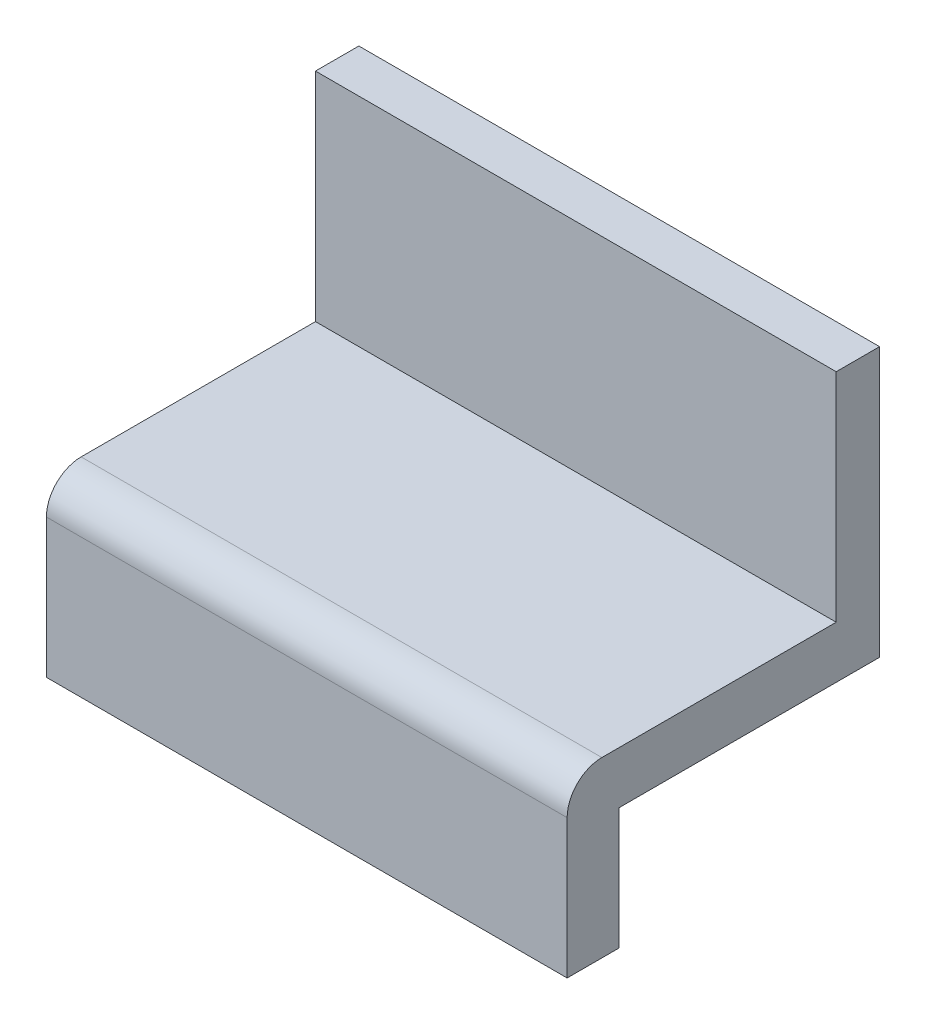
ISO-10303-21;
HEADER;
FILE_DESCRIPTION(('STEP AP214'),'2;1');
FILE_NAME('part.step','',(''),(''),'','','');
FILE_SCHEMA(('AUTOMOTIVE_DESIGN { 1 0 10303 214 1 1 1 1 }'));
ENDSEC;
DATA;
#1=APPLICATION_CONTEXT('core data for automotive mechanical design processes');
#2=APPLICATION_PROTOCOL_DEFINITION('international standard','automotive_design',2000,#1);
#3=PRODUCT_CONTEXT('',#1,'mechanical');
#4=PRODUCT('Part','Part','',(#3));
#5=PRODUCT_RELATED_PRODUCT_CATEGORY('part','',(#4));
#6=PRODUCT_DEFINITION_FORMATION('','',#4);
#7=PRODUCT_DEFINITION_CONTEXT('part definition',#1,'design');
#8=PRODUCT_DEFINITION('design','',#6,#7);
#9=PRODUCT_DEFINITION_SHAPE('','',#8);
#10=(LENGTH_UNIT() NAMED_UNIT(*) SI_UNIT(.MILLI.,.METRE.));
#11=(NAMED_UNIT(*) PLANE_ANGLE_UNIT() SI_UNIT($,.RADIAN.));
#12=(NAMED_UNIT(*) SI_UNIT($,.STERADIAN.) SOLID_ANGLE_UNIT());
#13=UNCERTAINTY_MEASURE_WITH_UNIT(LENGTH_MEASURE(1.E-05),#10,'distance_accuracy_value','');
#14=(GEOMETRIC_REPRESENTATION_CONTEXT(3) GLOBAL_UNCERTAINTY_ASSIGNED_CONTEXT((#13)) GLOBAL_UNIT_ASSIGNED_CONTEXT((#10,
#11,#12)) REPRESENTATION_CONTEXT('',''));
#15=CARTESIAN_POINT('',(0.,0.,0.));
#16=DIRECTION('',(0.,0.,1.));
#17=DIRECTION('',(1.,0.,0.));
#18=AXIS2_PLACEMENT_3D('',#15,#16,#17);
#19=CARTESIAN_POINT('',(0.,3.,0.));
#20=DIRECTION('',(0.,1.,0.));
#21=DIRECTION('',(0.,0.,1.));
#22=AXIS2_PLACEMENT_3D('',#19,#20,#21);
#23=PLANE('',#22);
#24=DIRECTION('',(0.,0.,-1.));
#25=VECTOR('',#24,1.);
#26=CARTESIAN_POINT('',(15.,3.,9.));
#27=LINE('',#26,#25);
#28=CARTESIAN_POINT('',(15.,3.,7.));
#29=VERTEX_POINT('',#28);
#30=CARTESIAN_POINT('',(15.,3.,-6.5));
#31=VERTEX_POINT('',#30);
#32=EDGE_CURVE('E58',#29,#31,#27,.T.);
#33=ORIENTED_EDGE('',*,*,#32,.T.);
#34=DIRECTION('',(1.,0.,0.));
#35=VECTOR('',#34,1.);
#36=CARTESIAN_POINT('',(-15.,3.,-6.5));
#37=LINE('',#36,#35);
#38=CARTESIAN_POINT('',(-15.,3.,-6.5));
#39=VERTEX_POINT('',#38);
#40=EDGE_CURVE('E62',#39,#31,#37,.T.);
#41=ORIENTED_EDGE('',*,*,#40,.F.);
#42=DIRECTION('',(0.,0.,1.));
#43=VECTOR('',#42,1.);
#44=CARTESIAN_POINT('',(-15.,3.,9.));
#45=LINE('',#44,#43);
#46=CARTESIAN_POINT('',(-15.,3.,7.));
#47=VERTEX_POINT('',#46);
#48=EDGE_CURVE('E136',#39,#47,#45,.T.);
#49=ORIENTED_EDGE('',*,*,#48,.T.);
#50=DIRECTION('',(1.,0.,0.));
#51=VECTOR('',#50,1.);
#52=CARTESIAN_POINT('',(15.,3.,7.));
#53=LINE('',#52,#51);
#54=EDGE_CURVE('E179',#47,#29,#53,.T.);
#55=ORIENTED_EDGE('',*,*,#54,.T.);
#56=EDGE_LOOP('',(#33,#41,#49,#55));
#57=FACE_BOUND('',#56,.T.);
#58=ADVANCED_FACE('F43',(#57),#23,.T.);
#59=CARTESIAN_POINT('',(0.,0.,0.));
#60=DIRECTION('',(0.,1.,0.));
#61=DIRECTION('',(0.,0.,1.));
#62=AXIS2_PLACEMENT_3D('',#59,#60,#61);
#63=PLANE('',#62);
#64=DIRECTION('',(1.,0.,0.));
#65=VECTOR('',#64,1.);
#66=CARTESIAN_POINT('',(-15.,0.,6.));
#67=LINE('',#66,#65);
#68=CARTESIAN_POINT('',(-15.,0.,6.));
#69=VERTEX_POINT('',#68);
#70=CARTESIAN_POINT('',(15.,0.,6.));
#71=VERTEX_POINT('',#70);
#72=EDGE_CURVE('E137',#69,#71,#67,.T.);
#73=ORIENTED_EDGE('',*,*,#72,.F.);
#74=DIRECTION('',(0.,0.,1.));
#75=VECTOR('',#74,1.);
#76=CARTESIAN_POINT('',(-15.,0.,9.));
#77=LINE('',#76,#75);
#78=CARTESIAN_POINT('',(-15.,0.,-8.99999999999999));
#79=VERTEX_POINT('',#78);
#80=EDGE_CURVE('E161',#79,#69,#77,.T.);
#81=ORIENTED_EDGE('',*,*,#80,.F.);
#82=DIRECTION('',(-1.,0.,0.));
#83=VECTOR('',#82,1.);
#84=CARTESIAN_POINT('',(15.,0.,-9.));
#85=LINE('',#84,#83);
#86=CARTESIAN_POINT('',(15.,0.,-9.));
#87=VERTEX_POINT('',#86);
#88=EDGE_CURVE('E163',#87,#79,#85,.T.);
#89=ORIENTED_EDGE('',*,*,#88,.F.);
#90=DIRECTION('',(0.,0.,-1.));
#91=VECTOR('',#90,1.);
#92=CARTESIAN_POINT('',(15.,0.,9.));
#93=LINE('',#92,#91);
#94=EDGE_CURVE('E168',#71,#87,#93,.T.);
#95=ORIENTED_EDGE('',*,*,#94,.F.);
#96=EDGE_LOOP('',(#73,#81,#89,#95));
#97=FACE_BOUND('',#96,.T.);
#98=ADVANCED_FACE('F201',(#97),#63,.F.);
#99=CARTESIAN_POINT('',(-15.,3.,9.));
#100=DIRECTION('',(1.,0.,0.));
#101=DIRECTION('',(0.,0.,-1.));
#102=AXIS2_PLACEMENT_3D('',#99,#100,#101);
#103=PLANE('',#102);
#104=DIRECTION('',(0.,-1.,0.));
#105=VECTOR('',#104,1.);
#106=CARTESIAN_POINT('',(-15.,3.,9.));
#107=LINE('',#106,#105);
#108=CARTESIAN_POINT('',(-15.,1.,9.));
#109=VERTEX_POINT('',#108);
#110=CARTESIAN_POINT('',(-15.,-7.,9.));
#111=VERTEX_POINT('',#110);
#112=EDGE_CURVE('E177',#109,#111,#107,.T.);
#113=ORIENTED_EDGE('',*,*,#112,.F.);
#114=CARTESIAN_POINT('',(-15.,1.,7.));
#115=DIRECTION('',(1.,0.,0.));
#116=DIRECTION('',(0.,0.,-1.));
#117=AXIS2_PLACEMENT_3D('',#114,#115,#116);
#118=CIRCLE('',#117,2.);
#119=EDGE_CURVE('E11',#109,#47,#118,.F.);
#120=ORIENTED_EDGE('',*,*,#119,.T.);
#121=ORIENTED_EDGE('',*,*,#48,.F.);
#122=DIRECTION('',(0.,-1.,0.));
#123=VECTOR('',#122,1.);
#124=CARTESIAN_POINT('',(-15.,15.5,-6.5));
#125=LINE('',#124,#123);
#126=CARTESIAN_POINT('',(-15.,15.5,-6.5));
#127=VERTEX_POINT('',#126);
#128=EDGE_CURVE('E117',#127,#39,#125,.T.);
#129=ORIENTED_EDGE('',*,*,#128,.F.);
#130=DIRECTION('',(0.,0.,1.));
#131=VECTOR('',#130,1.);
#132=CARTESIAN_POINT('',(-15.,15.5,-6.5));
#133=LINE('',#132,#131);
#134=CARTESIAN_POINT('',(-15.,15.5,-9.));
#135=VERTEX_POINT('',#134);
#136=EDGE_CURVE('E124',#135,#127,#133,.T.);
#137=ORIENTED_EDGE('',*,*,#136,.F.);
#138=DIRECTION('',(0.,-1.,0.));
#139=VECTOR('',#138,1.);
#140=CARTESIAN_POINT('',(-15.,3.,-8.99999999999999));
#141=LINE('',#140,#139);
#142=EDGE_CURVE('E165',#135,#79,#141,.T.);
#143=ORIENTED_EDGE('',*,*,#142,.T.);
#144=ORIENTED_EDGE('',*,*,#80,.T.);
#145=DIRECTION('',(0.,1.,0.));
#146=VECTOR('',#145,1.);
#147=CARTESIAN_POINT('',(-15.,-7.,6.));
#148=LINE('',#147,#146);
#149=CARTESIAN_POINT('',(-15.,-7.,6.));
#150=VERTEX_POINT('',#149);
#151=EDGE_CURVE('E158',#150,#69,#148,.T.);
#152=ORIENTED_EDGE('',*,*,#151,.F.);
#153=DIRECTION('',(0.,0.,-1.));
#154=VECTOR('',#153,1.);
#155=CARTESIAN_POINT('',(-15.,-7.,9.));
#156=LINE('',#155,#154);
#157=EDGE_CURVE('E140',#111,#150,#156,.T.);
#158=ORIENTED_EDGE('',*,*,#157,.F.);
#159=EDGE_LOOP('',(#113,#120,#121,#129,#137,#143,#144,#152,#158));
#160=FACE_BOUND('',#159,.T.);
#161=ADVANCED_FACE('F135',(#160),#103,.F.);
#162=CARTESIAN_POINT('',(15.,3.,9.));
#163=DIRECTION('',(0.,0.,-1.));
#164=DIRECTION('',(-1.,0.,0.));
#165=AXIS2_PLACEMENT_3D('',#162,#163,#164);
#166=PLANE('',#165);
#167=DIRECTION('',(0.,-1.,0.));
#168=VECTOR('',#167,1.);
#169=CARTESIAN_POINT('',(15.,3.,9.));
#170=LINE('',#169,#168);
#171=CARTESIAN_POINT('',(15.,1.,9.));
#172=VERTEX_POINT('',#171);
#173=CARTESIAN_POINT('',(15.,-7.,9.));
#174=VERTEX_POINT('',#173);
#175=EDGE_CURVE('E175',#172,#174,#170,.T.);
#176=ORIENTED_EDGE('',*,*,#175,.F.);
#177=DIRECTION('',(1.,0.,0.));
#178=VECTOR('',#177,1.);
#179=CARTESIAN_POINT('',(-15.,1.,9.));
#180=LINE('',#179,#178);
#181=EDGE_CURVE('E51',#172,#109,#180,.F.);
#182=ORIENTED_EDGE('',*,*,#181,.T.);
#183=ORIENTED_EDGE('',*,*,#112,.T.);
#184=DIRECTION('',(-1.,0.,0.));
#185=VECTOR('',#184,1.);
#186=CARTESIAN_POINT('',(-15.,-7.,9.));
#187=LINE('',#186,#185);
#188=EDGE_CURVE('E152',#174,#111,#187,.T.);
#189=ORIENTED_EDGE('',*,*,#188,.F.);
#190=EDGE_LOOP('',(#176,#182,#183,#189));
#191=FACE_BOUND('',#190,.T.);
#192=ADVANCED_FACE('F185',(#191),#166,.F.);
#193=CARTESIAN_POINT('',(15.,3.,9.));
#194=DIRECTION('',(-1.,0.,0.));
#195=DIRECTION('',(0.,0.,1.));
#196=AXIS2_PLACEMENT_3D('',#193,#194,#195);
#197=PLANE('',#196);
#198=ORIENTED_EDGE('',*,*,#32,.F.);
#199=CARTESIAN_POINT('',(15.,1.,7.));
#200=DIRECTION('',(-1.,0.,0.));
#201=DIRECTION('',(0.,0.,1.));
#202=AXIS2_PLACEMENT_3D('',#199,#200,#201);
#203=CIRCLE('',#202,2.);
#204=EDGE_CURVE('E181',#29,#172,#203,.F.);
#205=ORIENTED_EDGE('',*,*,#204,.T.);
#206=ORIENTED_EDGE('',*,*,#175,.T.);
#207=DIRECTION('',(0.,0.,1.));
#208=VECTOR('',#207,1.);
#209=CARTESIAN_POINT('',(15.,-7.,9.));
#210=LINE('',#209,#208);
#211=CARTESIAN_POINT('',(15.,-7.,6.));
#212=VERTEX_POINT('',#211);
#213=EDGE_CURVE('E149',#212,#174,#210,.T.);
#214=ORIENTED_EDGE('',*,*,#213,.F.);
#215=DIRECTION('',(0.,1.,0.));
#216=VECTOR('',#215,1.);
#217=CARTESIAN_POINT('',(15.,-7.,6.));
#218=LINE('',#217,#216);
#219=EDGE_CURVE('E154',#212,#71,#218,.T.);
#220=ORIENTED_EDGE('',*,*,#219,.T.);
#221=ORIENTED_EDGE('',*,*,#94,.T.);
#222=DIRECTION('',(0.,-1.,0.));
#223=VECTOR('',#222,1.);
#224=CARTESIAN_POINT('',(15.,3.,-9.));
#225=LINE('',#224,#223);
#226=CARTESIAN_POINT('',(15.,15.5,-9.));
#227=VERTEX_POINT('',#226);
#228=EDGE_CURVE('E172',#227,#87,#225,.T.);
#229=ORIENTED_EDGE('',*,*,#228,.F.);
#230=DIRECTION('',(0.,0.,-1.));
#231=VECTOR('',#230,1.);
#232=CARTESIAN_POINT('',(15.,15.5,-6.5));
#233=LINE('',#232,#231);
#234=CARTESIAN_POINT('',(15.,15.5,-6.5));
#235=VERTEX_POINT('',#234);
#236=EDGE_CURVE('E123',#235,#227,#233,.T.);
#237=ORIENTED_EDGE('',*,*,#236,.F.);
#238=DIRECTION('',(0.,-1.,0.));
#239=VECTOR('',#238,1.);
#240=CARTESIAN_POINT('',(15.,15.5,-6.5));
#241=LINE('',#240,#239);
#242=EDGE_CURVE('E119',#235,#31,#241,.T.);
#243=ORIENTED_EDGE('',*,*,#242,.T.);
#244=EDGE_LOOP('',(#198,#205,#206,#214,#220,#221,#229,#237,#243));
#245=FACE_BOUND('',#244,.T.);
#246=ADVANCED_FACE('F193',(#245),#197,.F.);
#247=CARTESIAN_POINT('',(15.,3.,-9.));
#248=DIRECTION('',(0.,0.,1.));
#249=DIRECTION('',(1.,0.,0.));
#250=AXIS2_PLACEMENT_3D('',#247,#248,#249);
#251=PLANE('',#250);
#252=ORIENTED_EDGE('',*,*,#88,.T.);
#253=ORIENTED_EDGE('',*,*,#142,.F.);
#254=DIRECTION('',(-1.,0.,0.));
#255=VECTOR('',#254,1.);
#256=CARTESIAN_POINT('',(-15.,15.5,-9.));
#257=LINE('',#256,#255);
#258=EDGE_CURVE('E130',#227,#135,#257,.T.);
#259=ORIENTED_EDGE('',*,*,#258,.F.);
#260=ORIENTED_EDGE('',*,*,#228,.T.);
#261=EDGE_LOOP('',(#252,#253,#259,#260));
#262=FACE_BOUND('',#261,.T.);
#263=ADVANCED_FACE('F197',(#262),#251,.F.);
#264=CARTESIAN_POINT('',(-15.,-7.,6.));
#265=DIRECTION('',(0.,0.,1.));
#266=DIRECTION('',(1.,0.,0.));
#267=AXIS2_PLACEMENT_3D('',#264,#265,#266);
#268=PLANE('',#267);
#269=ORIENTED_EDGE('',*,*,#72,.T.);
#270=ORIENTED_EDGE('',*,*,#219,.F.);
#271=DIRECTION('',(1.,0.,0.));
#272=VECTOR('',#271,1.);
#273=CARTESIAN_POINT('',(-15.,-7.,6.));
#274=LINE('',#273,#272);
#275=EDGE_CURVE('E147',#150,#212,#274,.T.);
#276=ORIENTED_EDGE('',*,*,#275,.F.);
#277=ORIENTED_EDGE('',*,*,#151,.T.);
#278=EDGE_LOOP('',(#269,#270,#276,#277));
#279=FACE_BOUND('',#278,.T.);
#280=ADVANCED_FACE('F204',(#279),#268,.F.);
#281=CARTESIAN_POINT('',(0.,-7.,0.));
#282=DIRECTION('',(0.,-1.,0.));
#283=DIRECTION('',(0.,0.,-1.));
#284=AXIS2_PLACEMENT_3D('',#281,#282,#283);
#285=PLANE('',#284);
#286=ORIENTED_EDGE('',*,*,#157,.T.);
#287=ORIENTED_EDGE('',*,*,#275,.T.);
#288=ORIENTED_EDGE('',*,*,#213,.T.);
#289=ORIENTED_EDGE('',*,*,#188,.T.);
#290=EDGE_LOOP('',(#286,#287,#288,#289));
#291=FACE_BOUND('',#290,.T.);
#292=ADVANCED_FACE('F207',(#291),#285,.T.);
#293=CARTESIAN_POINT('',(0.,1.,7.));
#294=DIRECTION('',(-1.,0.,0.));
#295=DIRECTION('',(0.,0.,1.));
#296=AXIS2_PLACEMENT_3D('',#293,#294,#295);
#297=CYLINDRICAL_SURFACE('',#296,2.);
#298=ORIENTED_EDGE('',*,*,#119,.F.);
#299=ORIENTED_EDGE('',*,*,#181,.F.);
#300=ORIENTED_EDGE('',*,*,#204,.F.);
#301=ORIENTED_EDGE('',*,*,#54,.F.);
#302=EDGE_LOOP('',(#298,#299,#300,#301));
#303=FACE_BOUND('',#302,.T.);
#304=ADVANCED_FACE('F45',(#303),#297,.T.);
#305=CARTESIAN_POINT('',(-15.,15.5,-6.5));
#306=DIRECTION('',(0.,0.,-1.));
#307=DIRECTION('',(-1.,0.,0.));
#308=AXIS2_PLACEMENT_3D('',#305,#306,#307);
#309=PLANE('',#308);
#310=ORIENTED_EDGE('',*,*,#40,.T.);
#311=ORIENTED_EDGE('',*,*,#242,.F.);
#312=DIRECTION('',(1.,0.,0.));
#313=VECTOR('',#312,1.);
#314=CARTESIAN_POINT('',(-15.,15.5,-6.5));
#315=LINE('',#314,#313);
#316=EDGE_CURVE('E113',#127,#235,#315,.T.);
#317=ORIENTED_EDGE('',*,*,#316,.F.);
#318=ORIENTED_EDGE('',*,*,#128,.T.);
#319=EDGE_LOOP('',(#310,#311,#317,#318));
#320=FACE_BOUND('',#319,.T.);
#321=ADVANCED_FACE('F115',(#320),#309,.F.);
#322=CARTESIAN_POINT('',(0.,15.5,0.));
#323=DIRECTION('',(0.,-1.,0.));
#324=DIRECTION('',(0.,0.,-1.));
#325=AXIS2_PLACEMENT_3D('',#322,#323,#324);
#326=PLANE('',#325);
#327=ORIENTED_EDGE('',*,*,#136,.T.);
#328=ORIENTED_EDGE('',*,*,#316,.T.);
#329=ORIENTED_EDGE('',*,*,#236,.T.);
#330=ORIENTED_EDGE('',*,*,#258,.T.);
#331=EDGE_LOOP('',(#327,#328,#329,#330));
#332=FACE_BOUND('',#331,.T.);
#333=ADVANCED_FACE('F128',(#332),#326,.F.);
#334=CLOSED_SHELL('',(#58,#98,#161,#192,#246,#263,#280,#292,#304,#321,#333));
#335=MANIFOLD_SOLID_BREP('B2',#334);
#336=ADVANCED_BREP_SHAPE_REPRESENTATION('',(#18,#335),#14);
#337=SHAPE_DEFINITION_REPRESENTATION(#9,#336);
ENDSEC;
END-ISO-10303-21;
